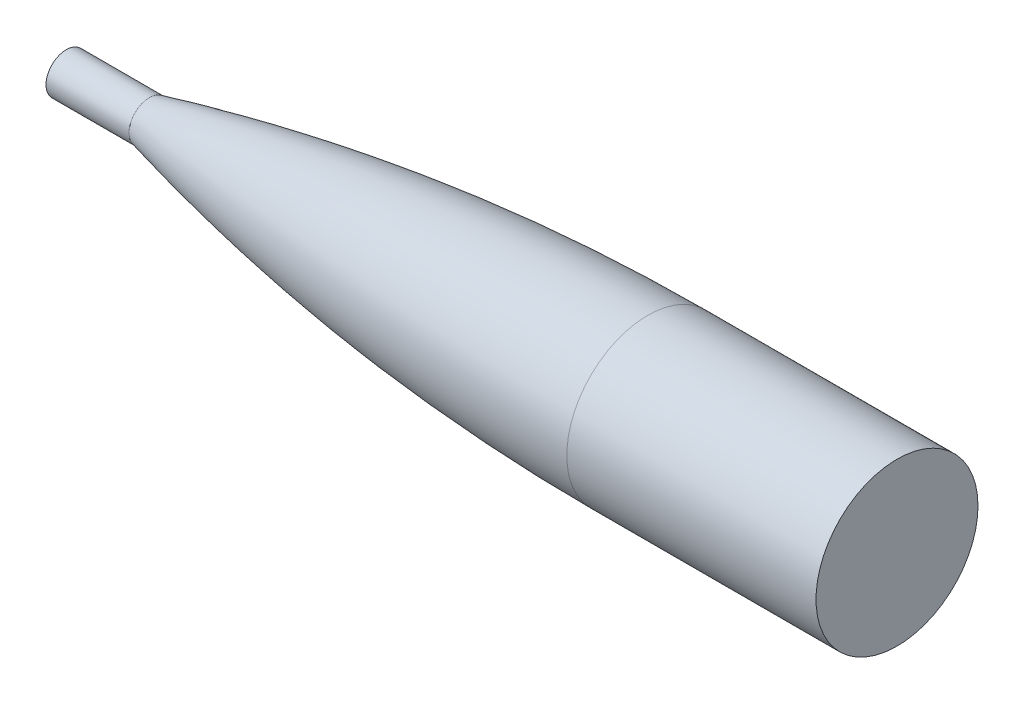
ISO-10303-21;
HEADER;
FILE_DESCRIPTION(('STEP AP214'),'2;1');
FILE_NAME('part.step','',(''),(''),'','','');
FILE_SCHEMA(('AUTOMOTIVE_DESIGN { 1 0 10303 214 1 1 1 1 }'));
ENDSEC;
DATA;
#1=APPLICATION_CONTEXT('core data for automotive mechanical design processes');
#2=APPLICATION_PROTOCOL_DEFINITION('international standard','automotive_design',2000,#1);
#3=PRODUCT_CONTEXT('',#1,'mechanical');
#4=PRODUCT('Part','Part','',(#3));
#5=PRODUCT_RELATED_PRODUCT_CATEGORY('part','',(#4));
#6=PRODUCT_DEFINITION_FORMATION('','',#4);
#7=PRODUCT_DEFINITION_CONTEXT('part definition',#1,'design');
#8=PRODUCT_DEFINITION('design','',#6,#7);
#9=PRODUCT_DEFINITION_SHAPE('','',#8);
#10=(LENGTH_UNIT() NAMED_UNIT(*) SI_UNIT(.MILLI.,.METRE.));
#11=(NAMED_UNIT(*) PLANE_ANGLE_UNIT() SI_UNIT($,.RADIAN.));
#12=(NAMED_UNIT(*) SI_UNIT($,.STERADIAN.) SOLID_ANGLE_UNIT());
#13=UNCERTAINTY_MEASURE_WITH_UNIT(LENGTH_MEASURE(1.E-05),#10,'distance_accuracy_value','');
#14=(GEOMETRIC_REPRESENTATION_CONTEXT(3) GLOBAL_UNCERTAINTY_ASSIGNED_CONTEXT((#13)) GLOBAL_UNIT_ASSIGNED_CONTEXT((#10,
#11,#12)) REPRESENTATION_CONTEXT('',''));
#15=CARTESIAN_POINT('',(0.,0.,0.));
#16=DIRECTION('',(0.,0.,1.));
#17=DIRECTION('',(1.,0.,0.));
#18=AXIS2_PLACEMENT_3D('',#15,#16,#17);
#19=CARTESIAN_POINT('',(355.600000087303,0.,-50.7999999734738));
#20=CARTESIAN_POINT('',(355.162608624885,0.,-50.7999999735659));
#21=CARTESIAN_POINT('',(354.282013928467,0.,-50.7994231748212));
#22=CARTESIAN_POINT('',(352.40570494871,0.,-50.7968275800228));
#23=CARTESIAN_POINT('',(350.344714481144,0.,-50.7899060027044));
#24=CARTESIAN_POINT('',(348.272494467081,0.,-50.7795236600886));
#25=CARTESIAN_POINT('',(346.163273231363,0.,-50.7656805804724));
#26=CARTESIAN_POINT('',(344.069774299166,0.,-50.748376801568));
#27=CARTESIAN_POINT('',(341.973247657925,0.,-50.7276123705328));
#28=CARTESIAN_POINT('',(339.329601827273,0.,-50.6970642265401));
#29=CARTESIAN_POINT('',(336.139078074932,0.,-50.6530928887572));
#30=CARTESIAN_POINT('',(332.401425999425,0.,-50.5911161036849));
#31=CARTESIAN_POINT('',(328.11696662755,0.,-50.5056092089642));
#32=CARTESIAN_POINT('',(323.832782668936,0.,-50.4056458049246));
#33=CARTESIAN_POINT('',(319.548981494171,0.,-50.2912270295979));
#34=CARTESIAN_POINT('',(315.265578413362,0.,-50.1623541856019));
#35=CARTESIAN_POINT('',(308.841173655417,0.,-49.9473660179873));
#36=CARTESIAN_POINT('',(299.206459448119,0.,-49.5706926353229));
#37=CARTESIAN_POINT('',(262.82240565497,0.,-47.8202304215008));
#38=CARTESIAN_POINT('',(219.035004800648,0.,-44.081341124365));
#39=CARTESIAN_POINT('',(168.000757519809,0.,-37.5160414552513));
#40=CARTESIAN_POINT('',(119.48562917264,0.,-28.8169974598621));
#41=CARTESIAN_POINT('',(97.4339898112845,0.,-24.3488229238283));
#42=CARTESIAN_POINT('',(82.7791362290027,0.,-21.1556615214593));
#43=CARTESIAN_POINT('',(77.5504414103591,0.,-19.9917100931957));
#44=CARTESIAN_POINT('',(73.3706786134794,0.,-19.0464466097069));
#45=CARTESIAN_POINT('',(69.7273952025031,0.,-18.2095760773824));
#46=CARTESIAN_POINT('',(66.6195661782511,0.,-17.4865360850931));
#47=CARTESIAN_POINT('',(64.0458560302311,0.,-16.881716673034));
#48=CARTESIAN_POINT('',(62.0056186070266,0.,-16.3987071516188));
#49=CARTESIAN_POINT('',(59.9691674563714,0.,-15.9130688516041));
#50=CARTESIAN_POINT('',(57.9182040289449,0.,-15.4202778528841));
#51=CARTESIAN_POINT('',(55.9042897804765,0.,-14.9330814332139));
#52=CARTESIAN_POINT('',(53.9013161125411,0.,-14.4450248471193));
#53=CARTESIAN_POINT('',(52.0797481244347,0.,-13.9973601803948));
#54=CARTESIAN_POINT('',(51.224607869347,0.,-13.7865417030788));
#55=CARTESIAN_POINT('',(50.8000000794835,0.,-13.6815677480592));
#56=B_SPLINE_CURVE_WITH_KNOTS('',4,(#19,#20,#21,#22,#23,#24,#25,#26,#27,#28,#29,#30,#31,#32,#33,
#34,#35,#36,#37,#38,#39,#40,#41,#42,#43,#44,#45,#46,#47,#48,#49,#50,#51,#52,#53,#54,#55),
.UNSPECIFIED.,.F.,.F.,(5,1,1,1,1,1,1,1,1,1,1,1,1,1,1,1,1,1,1,1,1,1,1,1,1,1,1,1,1,1,1,1,1,5),
(0.0828265796694398,0.0885105936404642,0.0941946077216388,0.0998786218028135,0.105562635883988,
0.111246649965163,0.116930664046338,0.122614678127512,0.128298692208687,0.139917178769152,
0.151535665329618,0.163154151890083,0.174772638450548,0.186391125129919,0.198009611809289,
0.20962809848866,0.244483558329257,0.290957504236502,0.593038155059935,0.685986046686238,
0.802170914093339,0.825407884941349,0.837026372593241,0.848644860245132,0.860263347897024,
0.871881835548916,0.877565849853662,0.883249864158408,0.888933878463154,0.8946178927679,
0.900301907072646,0.905985921377392,0.911669935682138,0.917353950101889),.UNSPECIFIED.);
#57=CARTESIAN_POINT('',(355.600000053401,0.,-1.26999997329437));
#58=DIRECTION('',(1.,0.,0.));
#59=AXIS1_PLACEMENT('',#57,#58);
#60=SURFACE_OF_REVOLUTION('',#56,#59);
#61=CARTESIAN_POINT('',(50.8000000630173,0.,-1.26999997329433));
#62=DIRECTION('',(-1.,0.,0.));
#63=DIRECTION('',(0.,0.,1.));
#64=AXIS2_PLACEMENT_3D('',#61,#62,#63);
#65=CIRCLE('',#64,12.4115677747649);
#66=CARTESIAN_POINT('',(50.8000000630173,0.,11.1415678014705));
#67=VERTEX_POINT('',#66);
#68=EDGE_CURVE('E50',#67,#67,#65,.T.);
#69=ORIENTED_EDGE('',*,*,#68,.F.);
#70=EDGE_LOOP('',(#69));
#71=FACE_BOUND('',#70,.T.);
#72=CARTESIAN_POINT('',(355.600000053401,0.,-1.26999997329437));
#73=DIRECTION('',(1.,0.,0.));
#74=DIRECTION('',(0.,0.,-1.));
#75=AXIS2_PLACEMENT_3D('',#72,#73,#74);
#76=CIRCLE('',#75,49.53);
#77=CARTESIAN_POINT('',(355.600000053401,0.,-50.7999999732944));
#78=VERTEX_POINT('',#77);
#79=EDGE_CURVE('E10',#78,#78,#76,.T.);
#80=ORIENTED_EDGE('',*,*,#79,.F.);
#81=EDGE_LOOP('',(#80));
#82=FACE_BOUND('',#81,.T.);
#83=ADVANCED_FACE('F35',(#71,#82),#60,.F.);
#84=CARTESIAN_POINT('',(508.000000053401,0.,-1.26999997329439));
#85=DIRECTION('',(-1.,0.,0.));
#86=DIRECTION('',(0.,0.,1.));
#87=AXIS2_PLACEMENT_3D('',#84,#85,#86);
#88=CYLINDRICAL_SURFACE('',#87,49.53);
#89=CARTESIAN_POINT('',(508.000000053401,0.,-1.26999997329439));
#90=DIRECTION('',(1.,0.,0.));
#91=DIRECTION('',(0.,0.,-1.));
#92=AXIS2_PLACEMENT_3D('',#89,#90,#91);
#93=CIRCLE('',#92,49.53);
#94=CARTESIAN_POINT('',(508.000000053401,0.,-50.7999999732944));
#95=VERTEX_POINT('',#94);
#96=EDGE_CURVE('E41',#95,#95,#93,.T.);
#97=ORIENTED_EDGE('',*,*,#96,.F.);
#98=EDGE_LOOP('',(#97));
#99=FACE_BOUND('',#98,.T.);
#100=ORIENTED_EDGE('',*,*,#79,.T.);
#101=EDGE_LOOP('',(#100));
#102=FACE_BOUND('',#101,.T.);
#103=ADVANCED_FACE('F66',(#99,#102),#88,.T.);
#104=CARTESIAN_POINT('',(508.000000053401,0.,-1.26999997329439));
#105=DIRECTION('',(1.,0.,0.));
#106=DIRECTION('',(0.,0.,-1.));
#107=AXIS2_PLACEMENT_3D('',#104,#105,#106);
#108=PLANE('',#107);
#109=ORIENTED_EDGE('',*,*,#96,.T.);
#110=EDGE_LOOP('',(#109));
#111=FACE_BOUND('',#110,.T.);
#112=ADVANCED_FACE('F70',(#111),#108,.T.);
#113=CARTESIAN_POINT('',(6.30172719562339E-08,0.,-1.26999997329433));
#114=DIRECTION('',(1.,0.,0.));
#115=DIRECTION('',(0.,0.,-1.));
#116=AXIS2_PLACEMENT_3D('',#113,#114,#115);
#117=CYLINDRICAL_SURFACE('',#116,12.4115677747649);
#118=CARTESIAN_POINT('',(6.30172719562339E-08,0.,-1.26999997329433));
#119=DIRECTION('',(-1.,0.,0.));
#120=DIRECTION('',(0.,0.,1.));
#121=AXIS2_PLACEMENT_3D('',#118,#119,#120);
#122=CIRCLE('',#121,12.4115677747649);
#123=CARTESIAN_POINT('',(6.30172734749632E-08,0.,11.1415678014705));
#124=VERTEX_POINT('',#123);
#125=EDGE_CURVE('E45',#124,#124,#122,.T.);
#126=ORIENTED_EDGE('',*,*,#125,.F.);
#127=EDGE_LOOP('',(#126));
#128=FACE_BOUND('',#127,.T.);
#129=ORIENTED_EDGE('',*,*,#68,.T.);
#130=EDGE_LOOP('',(#129));
#131=FACE_BOUND('',#130,.T.);
#132=ADVANCED_FACE('F62',(#128,#131),#117,.T.);
#133=CARTESIAN_POINT('',(6.30172719562339E-08,0.,-1.26999997329433));
#134=DIRECTION('',(-1.,0.,0.));
#135=DIRECTION('',(0.,0.,1.));
#136=AXIS2_PLACEMENT_3D('',#133,#134,#135);
#137=PLANE('',#136);
#138=ORIENTED_EDGE('',*,*,#125,.T.);
#139=EDGE_LOOP('',(#138));
#140=FACE_BOUND('',#139,.T.);
#141=ADVANCED_FACE('F79',(#140),#137,.T.);
#142=CLOSED_SHELL('',(#83,#103,#112,#132,#141));
#143=MANIFOLD_SOLID_BREP('B2',#142);
#144=ADVANCED_BREP_SHAPE_REPRESENTATION('',(#18,#143),#14);
#145=SHAPE_DEFINITION_REPRESENTATION(#9,#144);
ENDSEC;
END-ISO-10303-21;
